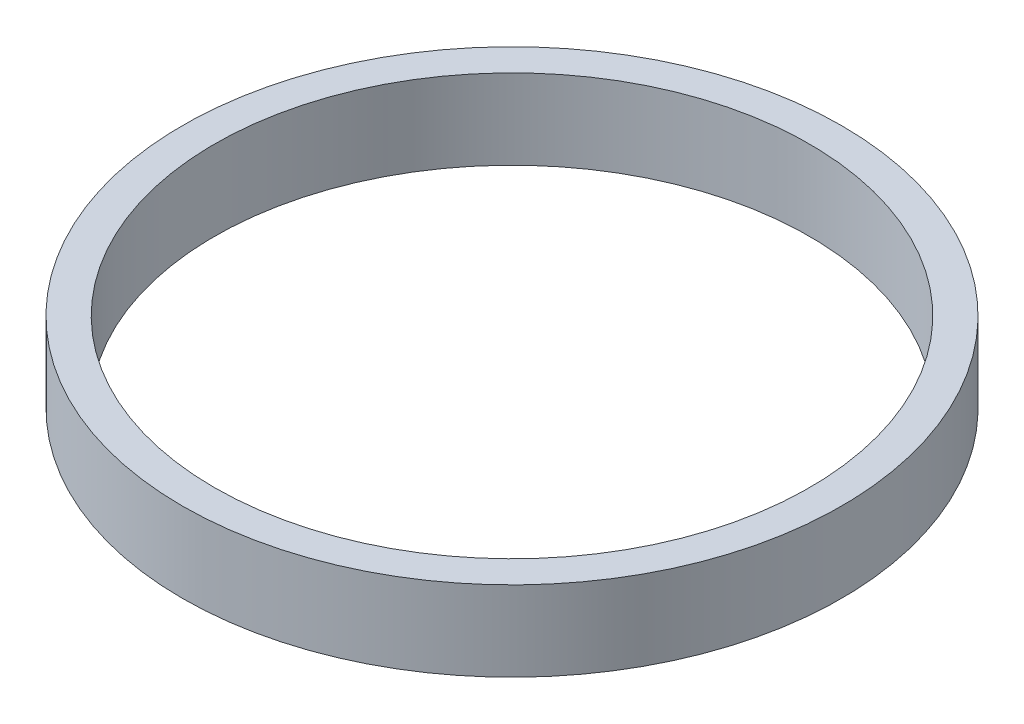
ISO-10303-21;
HEADER;
FILE_DESCRIPTION(('STEP AP214'),'2;1');
FILE_NAME('part.step','',(''),(''),'','','');
FILE_SCHEMA(('AUTOMOTIVE_DESIGN { 1 0 10303 214 1 1 1 1 }'));
ENDSEC;
DATA;
#1=APPLICATION_CONTEXT('core data for automotive mechanical design processes');
#2=APPLICATION_PROTOCOL_DEFINITION('international standard','automotive_design',2000,#1);
#3=PRODUCT_CONTEXT('',#1,'mechanical');
#4=PRODUCT('Part','Part','',(#3));
#5=PRODUCT_RELATED_PRODUCT_CATEGORY('part','',(#4));
#6=PRODUCT_DEFINITION_FORMATION('','',#4);
#7=PRODUCT_DEFINITION_CONTEXT('part definition',#1,'design');
#8=PRODUCT_DEFINITION('design','',#6,#7);
#9=PRODUCT_DEFINITION_SHAPE('','',#8);
#10=(LENGTH_UNIT() NAMED_UNIT(*) SI_UNIT(.MILLI.,.METRE.));
#11=(NAMED_UNIT(*) PLANE_ANGLE_UNIT() SI_UNIT($,.RADIAN.));
#12=(NAMED_UNIT(*) SI_UNIT($,.STERADIAN.) SOLID_ANGLE_UNIT());
#13=UNCERTAINTY_MEASURE_WITH_UNIT(LENGTH_MEASURE(1.E-05),#10,'distance_accuracy_value','');
#14=(GEOMETRIC_REPRESENTATION_CONTEXT(3) GLOBAL_UNCERTAINTY_ASSIGNED_CONTEXT((#13)) GLOBAL_UNIT_ASSIGNED_CONTEXT((#10,
#11,#12)) REPRESENTATION_CONTEXT('',''));
#15=CARTESIAN_POINT('',(0.,0.,0.));
#16=DIRECTION('',(0.,0.,1.));
#17=DIRECTION('',(1.,0.,0.));
#18=AXIS2_PLACEMENT_3D('',#15,#16,#17);
#19=CARTESIAN_POINT('',(0.,5.,0.));
#20=DIRECTION('',(0.,1.,0.));
#21=DIRECTION('',(0.,0.,1.));
#22=AXIS2_PLACEMENT_3D('',#19,#20,#21);
#23=PLANE('',#22);
#24=CARTESIAN_POINT('',(0.,5.,0.));
#25=DIRECTION('',(0.,1.,0.));
#26=DIRECTION('',(0.,0.,1.));
#27=AXIS2_PLACEMENT_3D('',#24,#25,#26);
#28=CIRCLE('',#27,20.6);
#29=CARTESIAN_POINT('',(0.,5.,20.6));
#30=VERTEX_POINT('',#29);
#31=EDGE_CURVE('E10',#30,#30,#28,.T.);
#32=ORIENTED_EDGE('',*,*,#31,.T.);
#33=EDGE_LOOP('',(#32));
#34=FACE_BOUND('',#33,.T.);
#35=CARTESIAN_POINT('',(0.,5.,0.));
#36=DIRECTION('',(0.,1.,0.));
#37=DIRECTION('',(0.,0.,1.));
#38=AXIS2_PLACEMENT_3D('',#35,#36,#37);
#39=CIRCLE('',#38,18.6);
#40=CARTESIAN_POINT('',(0.,5.,18.6));
#41=VERTEX_POINT('',#40);
#42=EDGE_CURVE('E54',#41,#41,#39,.T.);
#43=ORIENTED_EDGE('',*,*,#42,.F.);
#44=EDGE_LOOP('',(#43));
#45=FACE_BOUND('',#44,.T.);
#46=ADVANCED_FACE('F41',(#34,#45),#23,.T.);
#47=CARTESIAN_POINT('',(0.,0.,0.));
#48=DIRECTION('',(0.,1.,0.));
#49=DIRECTION('',(0.,0.,1.));
#50=AXIS2_PLACEMENT_3D('',#47,#48,#49);
#51=PLANE('',#50);
#52=CARTESIAN_POINT('',(0.,0.,0.));
#53=DIRECTION('',(0.,1.,0.));
#54=DIRECTION('',(0.,0.,1.));
#55=AXIS2_PLACEMENT_3D('',#52,#53,#54);
#56=CIRCLE('',#55,20.6);
#57=CARTESIAN_POINT('',(0.,0.,20.6));
#58=VERTEX_POINT('',#57);
#59=EDGE_CURVE('E45',#58,#58,#56,.T.);
#60=ORIENTED_EDGE('',*,*,#59,.F.);
#61=EDGE_LOOP('',(#60));
#62=FACE_BOUND('',#61,.T.);
#63=CARTESIAN_POINT('',(0.,0.,0.));
#64=DIRECTION('',(0.,1.,0.));
#65=DIRECTION('',(0.,0.,1.));
#66=AXIS2_PLACEMENT_3D('',#63,#64,#65);
#67=CIRCLE('',#66,18.6);
#68=CARTESIAN_POINT('',(0.,0.,18.6));
#69=VERTEX_POINT('',#68);
#70=EDGE_CURVE('E56',#69,#69,#67,.T.);
#71=ORIENTED_EDGE('',*,*,#70,.T.);
#72=EDGE_LOOP('',(#71));
#73=FACE_BOUND('',#72,.T.);
#74=ADVANCED_FACE('F68',(#62,#73),#51,.F.);
#75=CARTESIAN_POINT('',(0.,5.,0.));
#76=DIRECTION('',(0.,-1.,0.));
#77=DIRECTION('',(0.,0.,-1.));
#78=AXIS2_PLACEMENT_3D('',#75,#76,#77);
#79=CYLINDRICAL_SURFACE('',#78,20.6);
#80=ORIENTED_EDGE('',*,*,#31,.F.);
#81=EDGE_LOOP('',(#80));
#82=FACE_BOUND('',#81,.T.);
#83=ORIENTED_EDGE('',*,*,#59,.T.);
#84=EDGE_LOOP('',(#83));
#85=FACE_BOUND('',#84,.T.);
#86=ADVANCED_FACE('F43',(#82,#85),#79,.T.);
#87=CARTESIAN_POINT('',(0.,5.,0.));
#88=DIRECTION('',(0.,-1.,0.));
#89=DIRECTION('',(0.,0.,-1.));
#90=AXIS2_PLACEMENT_3D('',#87,#88,#89);
#91=CYLINDRICAL_SURFACE('',#90,18.6);
#92=ORIENTED_EDGE('',*,*,#42,.T.);
#93=EDGE_LOOP('',(#92));
#94=FACE_BOUND('',#93,.T.);
#95=ORIENTED_EDGE('',*,*,#70,.F.);
#96=EDGE_LOOP('',(#95));
#97=FACE_BOUND('',#96,.T.);
#98=ADVANCED_FACE('F64',(#94,#97),#91,.F.);
#99=CLOSED_SHELL('',(#46,#74,#86,#98));
#100=MANIFOLD_SOLID_BREP('B2',#99);
#101=ADVANCED_BREP_SHAPE_REPRESENTATION('',(#18,#100),#14);
#102=SHAPE_DEFINITION_REPRESENTATION(#9,#101);
ENDSEC;
END-ISO-10303-21;
